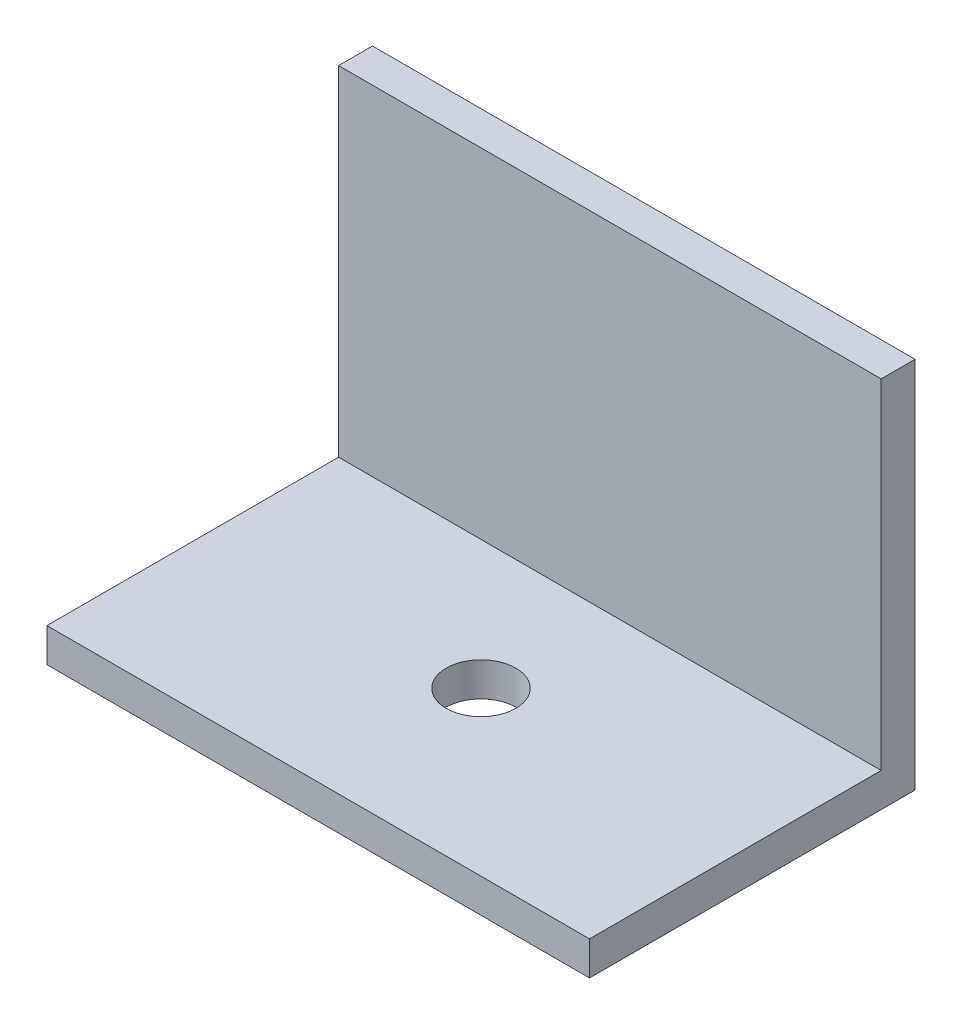
ISO-10303-21;
HEADER;
FILE_DESCRIPTION(('STEP AP214'),'2;1');
FILE_NAME('part.step','',(''),(''),'','','');
FILE_SCHEMA(('AUTOMOTIVE_DESIGN { 1 0 10303 214 1 1 1 1 }'));
ENDSEC;
DATA;
#1=APPLICATION_CONTEXT('core data for automotive mechanical design processes');
#2=APPLICATION_PROTOCOL_DEFINITION('international standard','automotive_design',2000,#1);
#3=PRODUCT_CONTEXT('',#1,'mechanical');
#4=PRODUCT('Part','Part','',(#3));
#5=PRODUCT_RELATED_PRODUCT_CATEGORY('part','',(#4));
#6=PRODUCT_DEFINITION_FORMATION('','',#4);
#7=PRODUCT_DEFINITION_CONTEXT('part definition',#1,'design');
#8=PRODUCT_DEFINITION('design','',#6,#7);
#9=PRODUCT_DEFINITION_SHAPE('','',#8);
#10=(LENGTH_UNIT() NAMED_UNIT(*) SI_UNIT(.MILLI.,.METRE.));
#11=(NAMED_UNIT(*) PLANE_ANGLE_UNIT() SI_UNIT($,.RADIAN.));
#12=(NAMED_UNIT(*) SI_UNIT($,.STERADIAN.) SOLID_ANGLE_UNIT());
#13=UNCERTAINTY_MEASURE_WITH_UNIT(LENGTH_MEASURE(1.E-05),#10,'distance_accuracy_value','');
#14=(GEOMETRIC_REPRESENTATION_CONTEXT(3) GLOBAL_UNCERTAINTY_ASSIGNED_CONTEXT((#13)) GLOBAL_UNIT_ASSIGNED_CONTEXT((#10,
#11,#12)) REPRESENTATION_CONTEXT('',''));
#15=CARTESIAN_POINT('',(0.,0.,0.));
#16=DIRECTION('',(0.,0.,1.));
#17=DIRECTION('',(1.,0.,0.));
#18=AXIS2_PLACEMENT_3D('',#15,#16,#17);
#19=CARTESIAN_POINT('',(25.4,3.175,-15.24));
#20=DIRECTION('',(-1.,0.,0.));
#21=DIRECTION('',(0.,0.,1.));
#22=AXIS2_PLACEMENT_3D('',#19,#20,#21);
#23=PLANE('',#22);
#24=DIRECTION('',(0.,0.,-1.));
#25=VECTOR('',#24,1.);
#26=CARTESIAN_POINT('',(25.4,0.,-15.24));
#27=LINE('',#26,#25);
#28=CARTESIAN_POINT('',(25.4,0.,15.24));
#29=VERTEX_POINT('',#28);
#30=CARTESIAN_POINT('',(25.4,0.,-15.24));
#31=VERTEX_POINT('',#30);
#32=EDGE_CURVE('E93',#29,#31,#27,.T.);
#33=ORIENTED_EDGE('',*,*,#32,.T.);
#34=DIRECTION('',(0.,-1.,0.));
#35=VECTOR('',#34,1.);
#36=CARTESIAN_POINT('',(25.4,3.175,-15.24));
#37=LINE('',#36,#35);
#38=CARTESIAN_POINT('',(25.4,34.925,-15.24));
#39=VERTEX_POINT('',#38);
#40=EDGE_CURVE('E11',#39,#31,#37,.T.);
#41=ORIENTED_EDGE('',*,*,#40,.F.);
#42=DIRECTION('',(0.,0.,-1.));
#43=VECTOR('',#42,1.);
#44=CARTESIAN_POINT('',(25.4,34.925,-15.24));
#45=LINE('',#44,#43);
#46=CARTESIAN_POINT('',(25.4,34.925,-12.065));
#47=VERTEX_POINT('',#46);
#48=EDGE_CURVE('E130',#47,#39,#45,.T.);
#49=ORIENTED_EDGE('',*,*,#48,.F.);
#50=DIRECTION('',(0.,-1.,0.));
#51=VECTOR('',#50,1.);
#52=CARTESIAN_POINT('',(25.4,34.925,-12.065));
#53=LINE('',#52,#51);
#54=CARTESIAN_POINT('',(25.4,3.175,-12.065));
#55=VERTEX_POINT('',#54);
#56=EDGE_CURVE('E102',#47,#55,#53,.T.);
#57=ORIENTED_EDGE('',*,*,#56,.T.);
#58=DIRECTION('',(0.,0.,-1.));
#59=VECTOR('',#58,1.);
#60=CARTESIAN_POINT('',(25.4,3.175,-15.24));
#61=LINE('',#60,#59);
#62=CARTESIAN_POINT('',(25.4,3.175,15.24));
#63=VERTEX_POINT('',#62);
#64=EDGE_CURVE('E87',#63,#55,#61,.T.);
#65=ORIENTED_EDGE('',*,*,#64,.F.);
#66=DIRECTION('',(0.,-1.,0.));
#67=VECTOR('',#66,1.);
#68=CARTESIAN_POINT('',(25.4,3.175,15.24));
#69=LINE('',#68,#67);
#70=EDGE_CURVE('E80',#63,#29,#69,.T.);
#71=ORIENTED_EDGE('',*,*,#70,.T.);
#72=EDGE_LOOP('',(#33,#41,#49,#57,#65,#71));
#73=FACE_BOUND('',#72,.T.);
#74=ADVANCED_FACE('F38',(#73),#23,.F.);
#75=CARTESIAN_POINT('',(-25.4,3.175,-15.24));
#76=DIRECTION('',(0.,0.,1.));
#77=DIRECTION('',(1.,0.,0.));
#78=AXIS2_PLACEMENT_3D('',#75,#76,#77);
#79=PLANE('',#78);
#80=DIRECTION('',(-1.,0.,0.));
#81=VECTOR('',#80,1.);
#82=CARTESIAN_POINT('',(-25.4,0.,-15.24));
#83=LINE('',#82,#81);
#84=CARTESIAN_POINT('',(-25.4,0.,-15.24));
#85=VERTEX_POINT('',#84);
#86=EDGE_CURVE('E97',#31,#85,#83,.T.);
#87=ORIENTED_EDGE('',*,*,#86,.T.);
#88=DIRECTION('',(0.,-1.,0.));
#89=VECTOR('',#88,1.);
#90=CARTESIAN_POINT('',(-25.4,3.175,-15.24));
#91=LINE('',#90,#89);
#92=CARTESIAN_POINT('',(-25.4,34.925,-15.24));
#93=VERTEX_POINT('',#92);
#94=EDGE_CURVE('E45',#93,#85,#91,.T.);
#95=ORIENTED_EDGE('',*,*,#94,.F.);
#96=DIRECTION('',(-1.,0.,0.));
#97=VECTOR('',#96,1.);
#98=CARTESIAN_POINT('',(-25.4,34.925,-15.24));
#99=LINE('',#98,#97);
#100=EDGE_CURVE('E122',#39,#93,#99,.T.);
#101=ORIENTED_EDGE('',*,*,#100,.F.);
#102=ORIENTED_EDGE('',*,*,#40,.T.);
#103=EDGE_LOOP('',(#87,#95,#101,#102));
#104=FACE_BOUND('',#103,.T.);
#105=ADVANCED_FACE('F120',(#104),#79,.F.);
#106=CARTESIAN_POINT('',(-25.4,3.175,-15.24));
#107=DIRECTION('',(1.,0.,0.));
#108=DIRECTION('',(0.,0.,-1.));
#109=AXIS2_PLACEMENT_3D('',#106,#107,#108);
#110=PLANE('',#109);
#111=DIRECTION('',(0.,0.,1.));
#112=VECTOR('',#111,1.);
#113=CARTESIAN_POINT('',(-25.4,0.,-15.24));
#114=LINE('',#113,#112);
#115=CARTESIAN_POINT('',(-25.4,0.,15.24));
#116=VERTEX_POINT('',#115);
#117=EDGE_CURVE('E88',#85,#116,#114,.T.);
#118=ORIENTED_EDGE('',*,*,#117,.T.);
#119=DIRECTION('',(0.,-1.,0.));
#120=VECTOR('',#119,1.);
#121=CARTESIAN_POINT('',(-25.4,3.175,15.24));
#122=LINE('',#121,#120);
#123=CARTESIAN_POINT('',(-25.4,3.175,15.24));
#124=VERTEX_POINT('',#123);
#125=EDGE_CURVE('E83',#124,#116,#122,.T.);
#126=ORIENTED_EDGE('',*,*,#125,.F.);
#127=DIRECTION('',(0.,0.,1.));
#128=VECTOR('',#127,1.);
#129=CARTESIAN_POINT('',(-25.4,3.175,-15.24));
#130=LINE('',#129,#128);
#131=CARTESIAN_POINT('',(-25.4,3.175,-12.065));
#132=VERTEX_POINT('',#131);
#133=EDGE_CURVE('E141',#132,#124,#130,.T.);
#134=ORIENTED_EDGE('',*,*,#133,.F.);
#135=DIRECTION('',(0.,-1.,0.));
#136=VECTOR('',#135,1.);
#137=CARTESIAN_POINT('',(-25.4,34.925,-12.065));
#138=LINE('',#137,#136);
#139=CARTESIAN_POINT('',(-25.4,34.925,-12.065));
#140=VERTEX_POINT('',#139);
#141=EDGE_CURVE('E98',#140,#132,#138,.T.);
#142=ORIENTED_EDGE('',*,*,#141,.F.);
#143=DIRECTION('',(0.,0.,1.));
#144=VECTOR('',#143,1.);
#145=CARTESIAN_POINT('',(-25.4,34.925,-15.24));
#146=LINE('',#145,#144);
#147=EDGE_CURVE('E116',#93,#140,#146,.T.);
#148=ORIENTED_EDGE('',*,*,#147,.F.);
#149=ORIENTED_EDGE('',*,*,#94,.T.);
#150=EDGE_LOOP('',(#118,#126,#134,#142,#148,#149));
#151=FACE_BOUND('',#150,.T.);
#152=ADVANCED_FACE('F112',(#151),#110,.F.);
#153=CARTESIAN_POINT('',(-25.4,3.175,15.24));
#154=DIRECTION('',(0.,0.,-1.));
#155=DIRECTION('',(-1.,0.,0.));
#156=AXIS2_PLACEMENT_3D('',#153,#154,#155);
#157=PLANE('',#156);
#158=DIRECTION('',(1.,0.,0.));
#159=VECTOR('',#158,1.);
#160=CARTESIAN_POINT('',(-25.4,0.,15.24));
#161=LINE('',#160,#159);
#162=EDGE_CURVE('E77',#116,#29,#161,.T.);
#163=ORIENTED_EDGE('',*,*,#162,.T.);
#164=ORIENTED_EDGE('',*,*,#70,.F.);
#165=DIRECTION('',(1.,0.,0.));
#166=VECTOR('',#165,1.);
#167=CARTESIAN_POINT('',(-25.4,3.175,15.24));
#168=LINE('',#167,#166);
#169=EDGE_CURVE('E58',#124,#63,#168,.T.);
#170=ORIENTED_EDGE('',*,*,#169,.F.);
#171=ORIENTED_EDGE('',*,*,#125,.T.);
#172=EDGE_LOOP('',(#163,#164,#170,#171));
#173=FACE_BOUND('',#172,.T.);
#174=ADVANCED_FACE('F79',(#173),#157,.F.);
#175=CARTESIAN_POINT('',(0.,3.175,0.));
#176=DIRECTION('',(0.,1.,0.));
#177=DIRECTION('',(0.,0.,1.));
#178=AXIS2_PLACEMENT_3D('',#175,#176,#177);
#179=PLANE('',#178);
#180=CARTESIAN_POINT('',(0.,3.175,0.));
#181=DIRECTION('',(0.,1.,0.));
#182=DIRECTION('',(0.,0.,1.));
#183=AXIS2_PLACEMENT_3D('',#180,#181,#182);
#184=CIRCLE('',#183,3.2639);
#185=CARTESIAN_POINT('',(0.,3.175,3.2639));
#186=VERTEX_POINT('',#185);
#187=EDGE_CURVE('E139',#186,#186,#184,.T.);
#188=ORIENTED_EDGE('',*,*,#187,.F.);
#189=EDGE_LOOP('',(#188));
#190=FACE_BOUND('',#189,.T.);
#191=DIRECTION('',(1.,0.,0.));
#192=VECTOR('',#191,1.);
#193=CARTESIAN_POINT('',(-25.4,3.175,-12.065));
#194=LINE('',#193,#192);
#195=EDGE_CURVE('E52',#132,#55,#194,.T.);
#196=ORIENTED_EDGE('',*,*,#195,.F.);
#197=ORIENTED_EDGE('',*,*,#133,.T.);
#198=ORIENTED_EDGE('',*,*,#169,.T.);
#199=ORIENTED_EDGE('',*,*,#64,.T.);
#200=EDGE_LOOP('',(#196,#197,#198,#199));
#201=FACE_BOUND('',#200,.T.);
#202=ADVANCED_FACE('F142',(#190,#201),#179,.T.);
#203=CARTESIAN_POINT('',(0.,0.,0.));
#204=DIRECTION('',(0.,1.,0.));
#205=DIRECTION('',(0.,0.,1.));
#206=AXIS2_PLACEMENT_3D('',#203,#204,#205);
#207=PLANE('',#206);
#208=CARTESIAN_POINT('',(0.,0.,0.));
#209=DIRECTION('',(0.,-1.,0.));
#210=DIRECTION('',(0.,0.,-1.));
#211=AXIS2_PLACEMENT_3D('',#208,#209,#210);
#212=CIRCLE('',#211,3.2639);
#213=CARTESIAN_POINT('',(0.,0.,-3.2639));
#214=VERTEX_POINT('',#213);
#215=EDGE_CURVE('E181',#214,#214,#212,.T.);
#216=ORIENTED_EDGE('',*,*,#215,.F.);
#217=EDGE_LOOP('',(#216));
#218=FACE_BOUND('',#217,.T.);
#219=ORIENTED_EDGE('',*,*,#32,.F.);
#220=ORIENTED_EDGE('',*,*,#162,.F.);
#221=ORIENTED_EDGE('',*,*,#117,.F.);
#222=ORIENTED_EDGE('',*,*,#86,.F.);
#223=EDGE_LOOP('',(#219,#220,#221,#222));
#224=FACE_BOUND('',#223,.T.);
#225=ADVANCED_FACE('F96',(#218,#224),#207,.F.);
#226=CARTESIAN_POINT('',(-25.4,34.925,-12.065));
#227=DIRECTION('',(0.,0.,-1.));
#228=DIRECTION('',(-1.,0.,0.));
#229=AXIS2_PLACEMENT_3D('',#226,#227,#228);
#230=PLANE('',#229);
#231=ORIENTED_EDGE('',*,*,#195,.T.);
#232=ORIENTED_EDGE('',*,*,#56,.F.);
#233=DIRECTION('',(1.,0.,0.));
#234=VECTOR('',#233,1.);
#235=CARTESIAN_POINT('',(-25.4,34.925,-12.065));
#236=LINE('',#235,#234);
#237=EDGE_CURVE('E132',#140,#47,#236,.T.);
#238=ORIENTED_EDGE('',*,*,#237,.F.);
#239=ORIENTED_EDGE('',*,*,#141,.T.);
#240=EDGE_LOOP('',(#231,#232,#238,#239));
#241=FACE_BOUND('',#240,.T.);
#242=ADVANCED_FACE('F145',(#241),#230,.F.);
#243=CARTESIAN_POINT('',(0.,34.925,0.));
#244=DIRECTION('',(0.,1.,0.));
#245=DIRECTION('',(0.,0.,1.));
#246=AXIS2_PLACEMENT_3D('',#243,#244,#245);
#247=PLANE('',#246);
#248=ORIENTED_EDGE('',*,*,#48,.T.);
#249=ORIENTED_EDGE('',*,*,#100,.T.);
#250=ORIENTED_EDGE('',*,*,#147,.T.);
#251=ORIENTED_EDGE('',*,*,#237,.T.);
#252=EDGE_LOOP('',(#248,#249,#250,#251));
#253=FACE_BOUND('',#252,.T.);
#254=ADVANCED_FACE('F127',(#253),#247,.T.);
#255=CARTESIAN_POINT('',(0.,50.8,0.));
#256=DIRECTION('',(0.,-1.,0.));
#257=DIRECTION('',(0.,0.,-1.));
#258=AXIS2_PLACEMENT_3D('',#255,#256,#257);
#259=CYLINDRICAL_SURFACE('',#258,3.2639);
#260=ORIENTED_EDGE('',*,*,#187,.T.);
#261=EDGE_LOOP('',(#260));
#262=FACE_BOUND('',#261,.T.);
#263=ORIENTED_EDGE('',*,*,#215,.T.);
#264=EDGE_LOOP('',(#263));
#265=FACE_BOUND('',#264,.T.);
#266=ADVANCED_FACE('F157',(#262,#265),#259,.F.);
#267=CLOSED_SHELL('',(#74,#105,#152,#174,#202,#225,#242,#254,#266));
#268=MANIFOLD_SOLID_BREP('B2',#267);
#269=ADVANCED_BREP_SHAPE_REPRESENTATION('',(#18,#268),#14);
#270=SHAPE_DEFINITION_REPRESENTATION(#9,#269);
ENDSEC;
END-ISO-10303-21;
